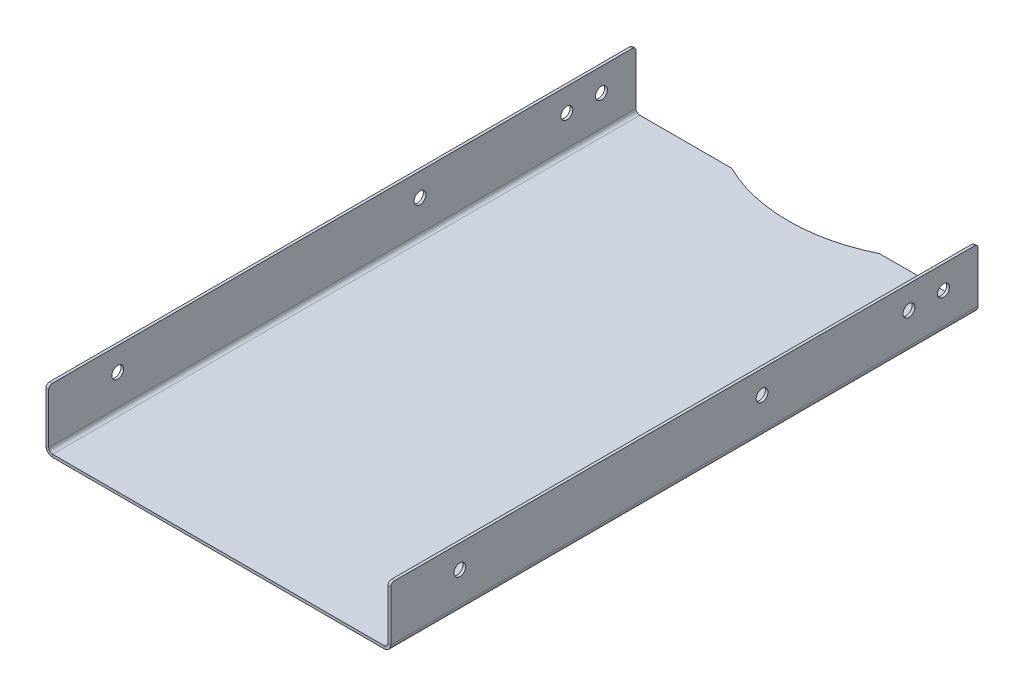
ISO-10303-21;
HEADER;
FILE_DESCRIPTION(('STEP AP214'),'2;1');
FILE_NAME('part.step','',(''),(''),'','','');
FILE_SCHEMA(('AUTOMOTIVE_DESIGN { 1 0 10303 214 1 1 1 1 }'));
ENDSEC;
DATA;
#1=APPLICATION_CONTEXT('core data for automotive mechanical design processes');
#2=APPLICATION_PROTOCOL_DEFINITION('international standard','automotive_design',2000,#1);
#3=PRODUCT_CONTEXT('',#1,'mechanical');
#4=PRODUCT('Part','Part','',(#3));
#5=PRODUCT_RELATED_PRODUCT_CATEGORY('part','',(#4));
#6=PRODUCT_DEFINITION_FORMATION('','',#4);
#7=PRODUCT_DEFINITION_CONTEXT('part definition',#1,'design');
#8=PRODUCT_DEFINITION('design','',#6,#7);
#9=PRODUCT_DEFINITION_SHAPE('','',#8);
#10=(LENGTH_UNIT() NAMED_UNIT(*) SI_UNIT(.MILLI.,.METRE.));
#11=(NAMED_UNIT(*) PLANE_ANGLE_UNIT() SI_UNIT($,.RADIAN.));
#12=(NAMED_UNIT(*) SI_UNIT($,.STERADIAN.) SOLID_ANGLE_UNIT());
#13=UNCERTAINTY_MEASURE_WITH_UNIT(LENGTH_MEASURE(1.E-05),#10,'distance_accuracy_value','');
#14=(GEOMETRIC_REPRESENTATION_CONTEXT(3) GLOBAL_UNCERTAINTY_ASSIGNED_CONTEXT((#13)) GLOBAL_UNIT_ASSIGNED_CONTEXT((#10,
#11,#12)) REPRESENTATION_CONTEXT('',''));
#15=CARTESIAN_POINT('',(0.,0.,0.));
#16=DIRECTION('',(0.,0.,1.));
#17=DIRECTION('',(1.,0.,0.));
#18=AXIS2_PLACEMENT_3D('',#15,#16,#17);
#19=CARTESIAN_POINT('',(0.,-1.9939,0.));
#20=DIRECTION('',(0.,-1.,0.));
#21=DIRECTION('',(0.,0.,-1.));
#22=AXIS2_PLACEMENT_3D('',#19,#20,#21);
#23=PLANE('',#22);
#24=DIRECTION('',(0.,0.,1.));
#25=VECTOR('',#24,1.);
#26=CARTESIAN_POINT('',(4.83996999999999,-1.9939,0.));
#27=LINE('',#26,#25);
#28=CARTESIAN_POINT('',(4.83996999999999,-1.9939,0.));
#29=VERTEX_POINT('',#28);
#30=CARTESIAN_POINT('',(4.83996999999999,-1.9939,-431.8));
#31=VERTEX_POINT('',#30);
#32=EDGE_CURVE('E279',#29,#31,#27,.F.);
#33=ORIENTED_EDGE('',*,*,#32,.T.);
#34=DIRECTION('',(1.,0.,0.));
#35=VECTOR('',#34,1.);
#36=CARTESIAN_POINT('',(38.6039093751587,-1.9939,-431.8));
#37=LINE('',#36,#35);
#38=CARTESIAN_POINT('',(72.3678487503174,-1.9939,-431.8));
#39=VERTEX_POINT('',#38);
#40=EDGE_CURVE('E380',#39,#31,#37,.F.);
#41=ORIENTED_EDGE('',*,*,#40,.F.);
#42=CARTESIAN_POINT('',(126.746,-1.9939,-541.866666666666));
#43=DIRECTION('',(0.,-1.,0.));
#44=DIRECTION('',(0.,0.,1.));
#45=AXIS2_PLACEMENT_3D('',#42,#43,#44);
#46=CIRCLE('',#45,122.766666666667);
#47=CARTESIAN_POINT('',(181.124151249683,-1.9939,-431.8));
#48=VERTEX_POINT('',#47);
#49=EDGE_CURVE('E237',#48,#39,#46,.T.);
#50=ORIENTED_EDGE('',*,*,#49,.F.);
#51=DIRECTION('',(1.,0.,0.));
#52=VECTOR('',#51,1.);
#53=CARTESIAN_POINT('',(0.,-1.9939,-431.8));
#54=LINE('',#53,#52);
#55=CARTESIAN_POINT('',(248.65203,-1.9939,-431.8));
#56=VERTEX_POINT('',#55);
#57=EDGE_CURVE('E207',#48,#56,#54,.T.);
#58=ORIENTED_EDGE('',*,*,#57,.T.);
#59=DIRECTION('',(0.,0.,-1.));
#60=VECTOR('',#59,1.);
#61=CARTESIAN_POINT('',(248.65203,-1.99390000000002,-457.2));
#62=LINE('',#61,#60);
#63=CARTESIAN_POINT('',(248.65203,-1.9939,0.));
#64=VERTEX_POINT('',#63);
#65=EDGE_CURVE('E233',#56,#64,#62,.F.);
#66=ORIENTED_EDGE('',*,*,#65,.T.);
#67=DIRECTION('',(1.,0.,0.));
#68=VECTOR('',#67,1.);
#69=CARTESIAN_POINT('',(0.,-1.9939,0.));
#70=LINE('',#69,#68);
#71=EDGE_CURVE('E293',#29,#64,#70,.T.);
#72=ORIENTED_EDGE('',*,*,#71,.F.);
#73=EDGE_LOOP('',(#33,#41,#50,#58,#66,#72));
#74=FACE_BOUND('',#73,.T.);
#75=ADVANCED_FACE('F78',(#74),#23,.T.);
#76=CARTESIAN_POINT('',(0.,0.,0.));
#77=DIRECTION('',(0.,-1.,0.));
#78=DIRECTION('',(0.,0.,-1.));
#79=AXIS2_PLACEMENT_3D('',#76,#77,#78);
#80=PLANE('',#79);
#81=DIRECTION('',(-1.,0.,0.));
#82=VECTOR('',#81,1.);
#83=CARTESIAN_POINT('',(0.,0.,-431.8));
#84=LINE('',#83,#82);
#85=CARTESIAN_POINT('',(72.3678487503174,0.,-431.8));
#86=VERTEX_POINT('',#85);
#87=CARTESIAN_POINT('',(4.83996999999999,0.,-431.8));
#88=VERTEX_POINT('',#87);
#89=EDGE_CURVE('E419',#86,#88,#84,.T.);
#90=ORIENTED_EDGE('',*,*,#89,.T.);
#91=DIRECTION('',(0.,0.,1.));
#92=VECTOR('',#91,1.);
#93=CARTESIAN_POINT('',(4.83996999999999,0.,0.));
#94=LINE('',#93,#92);
#95=CARTESIAN_POINT('',(4.83996999999999,0.,0.));
#96=VERTEX_POINT('',#95);
#97=EDGE_CURVE('E285',#96,#88,#94,.F.);
#98=ORIENTED_EDGE('',*,*,#97,.F.);
#99=DIRECTION('',(1.,0.,0.));
#100=VECTOR('',#99,1.);
#101=CARTESIAN_POINT('',(0.,0.,0.));
#102=LINE('',#101,#100);
#103=CARTESIAN_POINT('',(248.65203,0.,0.));
#104=VERTEX_POINT('',#103);
#105=EDGE_CURVE('E292',#96,#104,#102,.T.);
#106=ORIENTED_EDGE('',*,*,#105,.T.);
#107=DIRECTION('',(0.,0.,-1.));
#108=VECTOR('',#107,1.);
#109=CARTESIAN_POINT('',(248.65203,0.,-457.2));
#110=LINE('',#109,#108);
#111=CARTESIAN_POINT('',(248.65203,0.,-431.8));
#112=VERTEX_POINT('',#111);
#113=EDGE_CURVE('E249',#112,#104,#110,.F.);
#114=ORIENTED_EDGE('',*,*,#113,.F.);
#115=DIRECTION('',(1.,0.,0.));
#116=VECTOR('',#115,1.);
#117=CARTESIAN_POINT('',(214.888090624841,0.,-431.8));
#118=LINE('',#117,#116);
#119=CARTESIAN_POINT('',(181.124151249683,0.,-431.8));
#120=VERTEX_POINT('',#119);
#121=EDGE_CURVE('E210',#120,#112,#118,.T.);
#122=ORIENTED_EDGE('',*,*,#121,.F.);
#123=CARTESIAN_POINT('',(126.746,0.,-541.866666666666));
#124=DIRECTION('',(0.,-1.,0.));
#125=DIRECTION('',(0.,0.,-1.));
#126=AXIS2_PLACEMENT_3D('',#123,#124,#125);
#127=CIRCLE('',#126,122.766666666667);
#128=EDGE_CURVE('E439',#120,#86,#127,.T.);
#129=ORIENTED_EDGE('',*,*,#128,.T.);
#130=EDGE_LOOP('',(#90,#98,#106,#114,#122,#129));
#131=FACE_BOUND('',#130,.T.);
#132=ADVANCED_FACE('F509',(#131),#80,.F.);
#133=CARTESIAN_POINT('',(4.83996999999999,2.84607,0.));
#134=DIRECTION('',(0.,0.,1.));
#135=DIRECTION('',(-1.,0.,0.));
#136=AXIS2_PLACEMENT_3D('',#133,#134,#135);
#137=CYLINDRICAL_SURFACE('',#136,4.83997);
#138=DIRECTION('',(0.,0.,1.));
#139=VECTOR('',#138,1.);
#140=CARTESIAN_POINT('',(0.,2.84606999999998,-457.2));
#141=LINE('',#140,#139);
#142=CARTESIAN_POINT('',(0.,2.84606999999998,0.));
#143=VERTEX_POINT('',#142);
#144=CARTESIAN_POINT('',(0.,2.84606999999998,-431.8));
#145=VERTEX_POINT('',#144);
#146=EDGE_CURVE('E272',#143,#145,#141,.F.);
#147=ORIENTED_EDGE('',*,*,#146,.T.);
#148=CARTESIAN_POINT('',(4.83996999999999,2.84607,-431.8));
#149=DIRECTION('',(0.,0.,1.));
#150=DIRECTION('',(1.,0.,0.));
#151=AXIS2_PLACEMENT_3D('',#148,#149,#150);
#152=CIRCLE('',#151,4.83997);
#153=EDGE_CURVE('E385',#31,#145,#152,.F.);
#154=ORIENTED_EDGE('',*,*,#153,.F.);
#155=ORIENTED_EDGE('',*,*,#32,.F.);
#156=CARTESIAN_POINT('',(4.83996999999999,2.84607,0.));
#157=DIRECTION('',(0.,0.,1.));
#158=DIRECTION('',(1.,0.,0.));
#159=AXIS2_PLACEMENT_3D('',#156,#157,#158);
#160=CIRCLE('',#159,4.83997);
#161=EDGE_CURVE('E282',#143,#29,#160,.T.);
#162=ORIENTED_EDGE('',*,*,#161,.F.);
#163=EDGE_LOOP('',(#147,#154,#155,#162));
#164=FACE_BOUND('',#163,.T.);
#165=ADVANCED_FACE('F383',(#164),#137,.T.);
#166=CARTESIAN_POINT('',(4.83996999999999,2.84607,0.));
#167=DIRECTION('',(0.,0.,1.));
#168=DIRECTION('',(-1.,0.,0.));
#169=AXIS2_PLACEMENT_3D('',#166,#167,#168);
#170=CYLINDRICAL_SURFACE('',#169,2.84607);
#171=CARTESIAN_POINT('',(4.83996999999999,2.84607,-431.8));
#172=DIRECTION('',(0.,0.,1.));
#173=DIRECTION('',(1.,0.,0.));
#174=AXIS2_PLACEMENT_3D('',#171,#172,#173);
#175=CIRCLE('',#174,2.84607);
#176=CARTESIAN_POINT('',(1.99389999999999,2.84606999999999,-431.8));
#177=VERTEX_POINT('',#176);
#178=EDGE_CURVE('E430',#88,#177,#175,.F.);
#179=ORIENTED_EDGE('',*,*,#178,.T.);
#180=DIRECTION('',(0.,0.,1.));
#181=VECTOR('',#180,1.);
#182=CARTESIAN_POINT('',(1.99389999999999,2.84606999999999,-457.2));
#183=LINE('',#182,#181);
#184=CARTESIAN_POINT('',(1.99389999999999,2.84606999999999,0.));
#185=VERTEX_POINT('',#184);
#186=EDGE_CURVE('E258',#177,#185,#183,.T.);
#187=ORIENTED_EDGE('',*,*,#186,.T.);
#188=CARTESIAN_POINT('',(4.83996999999999,2.84607,0.));
#189=DIRECTION('',(0.,0.,1.));
#190=DIRECTION('',(1.,0.,0.));
#191=AXIS2_PLACEMENT_3D('',#188,#189,#190);
#192=CIRCLE('',#191,2.84607);
#193=EDGE_CURVE('E262',#185,#96,#192,.T.);
#194=ORIENTED_EDGE('',*,*,#193,.T.);
#195=ORIENTED_EDGE('',*,*,#97,.T.);
#196=EDGE_LOOP('',(#179,#187,#194,#195));
#197=FACE_BOUND('',#196,.T.);
#198=ADVANCED_FACE('F584',(#197),#170,.F.);
#199=CARTESIAN_POINT('',(0.,0.,0.));
#200=DIRECTION('',(1.,0.,0.));
#201=DIRECTION('',(0.,1.,0.));
#202=AXIS2_PLACEMENT_3D('',#199,#200,#201);
#203=PLANE('',#202);
#204=CARTESIAN_POINT('',(0.,25.3999999999999,-273.05));
#205=DIRECTION('',(-1.,0.,0.));
#206=DIRECTION('',(0.,0.,1.));
#207=AXIS2_PLACEMENT_3D('',#204,#205,#206);
#208=CIRCLE('',#207,4.36879999999997);
#209=CARTESIAN_POINT('',(0.,25.3999999999999,-268.6812));
#210=VERTEX_POINT('',#209);
#211=EDGE_CURVE('E467',#210,#210,#208,.T.);
#212=ORIENTED_EDGE('',*,*,#211,.F.);
#213=EDGE_LOOP('',(#212));
#214=FACE_BOUND('',#213,.T.);
#215=CARTESIAN_POINT('',(0.,25.3999999999999,-381.));
#216=DIRECTION('',(-1.,0.,0.));
#217=DIRECTION('',(0.,0.,1.));
#218=AXIS2_PLACEMENT_3D('',#215,#216,#217);
#219=CIRCLE('',#218,4.36879999999997);
#220=CARTESIAN_POINT('',(0.,25.3999999999999,-376.6312));
#221=VERTEX_POINT('',#220);
#222=EDGE_CURVE('E456',#221,#221,#219,.T.);
#223=ORIENTED_EDGE('',*,*,#222,.F.);
#224=EDGE_LOOP('',(#223));
#225=FACE_BOUND('',#224,.T.);
#226=CARTESIAN_POINT('',(0.,25.4,-50.8));
#227=DIRECTION('',(-1.,0.,0.));
#228=DIRECTION('',(0.,0.,1.));
#229=AXIS2_PLACEMENT_3D('',#226,#227,#228);
#230=CIRCLE('',#229,4.36879999999997);
#231=CARTESIAN_POINT('',(0.,25.4,-46.4312));
#232=VERTEX_POINT('',#231);
#233=EDGE_CURVE('E449',#232,#232,#230,.T.);
#234=ORIENTED_EDGE('',*,*,#233,.F.);
#235=EDGE_LOOP('',(#234));
#236=FACE_BOUND('',#235,.T.);
#237=CARTESIAN_POINT('',(0.,25.3999999999999,-406.4));
#238=DIRECTION('',(-1.,0.,0.));
#239=DIRECTION('',(0.,0.,1.));
#240=AXIS2_PLACEMENT_3D('',#237,#238,#239);
#241=CIRCLE('',#240,4.36879999999997);
#242=CARTESIAN_POINT('',(0.,25.3999999999999,-402.0312));
#243=VERTEX_POINT('',#242);
#244=EDGE_CURVE('E442',#243,#243,#241,.T.);
#245=ORIENTED_EDGE('',*,*,#244,.F.);
#246=EDGE_LOOP('',(#245));
#247=FACE_BOUND('',#246,.T.);
#248=DIRECTION('',(0.,0.,-1.));
#249=VECTOR('',#248,1.);
#250=CARTESIAN_POINT('',(-1.48234680870058E-13,42.4561,0.));
#251=LINE('',#250,#249);
#252=CARTESIAN_POINT('',(-1.48234680870058E-13,42.4561,-2.53999999999999));
#253=VERTEX_POINT('',#252);
#254=CARTESIAN_POINT('',(-1.48234680870058E-13,42.4561,-429.26));
#255=VERTEX_POINT('',#254);
#256=EDGE_CURVE('E259',#253,#255,#251,.T.);
#257=ORIENTED_EDGE('',*,*,#256,.T.);
#258=CARTESIAN_POINT('',(-1.39366318269396E-13,39.9161,-429.26));
#259=DIRECTION('',(1.,0.,0.));
#260=DIRECTION('',(0.,1.,0.));
#261=AXIS2_PLACEMENT_3D('',#258,#259,#260);
#262=CIRCLE('',#261,2.54);
#263=CARTESIAN_POINT('',(-1.39366318269396E-13,39.9161,-431.8));
#264=VERTEX_POINT('',#263);
#265=EDGE_CURVE('E321',#255,#264,#262,.F.);
#266=ORIENTED_EDGE('',*,*,#265,.T.);
#267=DIRECTION('',(0.,-1.,0.));
#268=VECTOR('',#267,1.);
#269=CARTESIAN_POINT('',(0.,0.,-431.8));
#270=LINE('',#269,#268);
#271=EDGE_CURVE('E398',#264,#145,#270,.T.);
#272=ORIENTED_EDGE('',*,*,#271,.T.);
#273=ORIENTED_EDGE('',*,*,#146,.F.);
#274=DIRECTION('',(0.,1.,0.));
#275=VECTOR('',#274,1.);
#276=CARTESIAN_POINT('',(0.,0.,0.));
#277=LINE('',#276,#275);
#278=CARTESIAN_POINT('',(-1.39366318269396E-13,39.9161,0.));
#279=VERTEX_POINT('',#278);
#280=EDGE_CURVE('E263',#143,#279,#277,.T.);
#281=ORIENTED_EDGE('',*,*,#280,.T.);
#282=CARTESIAN_POINT('',(-1.39366318269396E-13,39.9161,-2.53999999999999));
#283=DIRECTION('',(1.,0.,0.));
#284=DIRECTION('',(0.,1.,0.));
#285=AXIS2_PLACEMENT_3D('',#282,#283,#284);
#286=CIRCLE('',#285,2.54);
#287=EDGE_CURVE('E319',#279,#253,#286,.F.);
#288=ORIENTED_EDGE('',*,*,#287,.T.);
#289=EDGE_LOOP('',(#257,#266,#272,#273,#281,#288));
#290=FACE_BOUND('',#289,.T.);
#291=ADVANCED_FACE('F395',(#214,#225,#236,#247,#290),#203,.F.);
#292=CARTESIAN_POINT('',(1.9939,0.,0.));
#293=DIRECTION('',(1.,0.,0.));
#294=DIRECTION('',(0.,1.,0.));
#295=AXIS2_PLACEMENT_3D('',#292,#293,#294);
#296=PLANE('',#295);
#297=CARTESIAN_POINT('',(1.99389999999991,25.3999999999999,-406.4));
#298=DIRECTION('',(1.,0.,0.));
#299=DIRECTION('',(0.,1.,0.));
#300=AXIS2_PLACEMENT_3D('',#297,#298,#299);
#301=CIRCLE('',#300,4.36879999999995);
#302=CARTESIAN_POINT('',(1.9938999999999,29.7687999999999,-406.4));
#303=VERTEX_POINT('',#302);
#304=EDGE_CURVE('E312',#303,#303,#301,.T.);
#305=ORIENTED_EDGE('',*,*,#304,.F.);
#306=EDGE_LOOP('',(#305));
#307=FACE_BOUND('',#306,.T.);
#308=CARTESIAN_POINT('',(1.99389999999991,25.4,-50.8));
#309=DIRECTION('',(1.,0.,0.));
#310=DIRECTION('',(0.,1.,0.));
#311=AXIS2_PLACEMENT_3D('',#308,#309,#310);
#312=CIRCLE('',#311,4.36879999999995);
#313=CARTESIAN_POINT('',(1.9938999999999,29.7687999999999,-50.8));
#314=VERTEX_POINT('',#313);
#315=EDGE_CURVE('E307',#314,#314,#312,.T.);
#316=ORIENTED_EDGE('',*,*,#315,.F.);
#317=EDGE_LOOP('',(#316));
#318=FACE_BOUND('',#317,.T.);
#319=CARTESIAN_POINT('',(1.99389999999991,25.3999999999999,-381.));
#320=DIRECTION('',(1.,0.,0.));
#321=DIRECTION('',(0.,1.,0.));
#322=AXIS2_PLACEMENT_3D('',#319,#320,#321);
#323=CIRCLE('',#322,4.36879999999995);
#324=CARTESIAN_POINT('',(1.9938999999999,29.7687999999999,-381.));
#325=VERTEX_POINT('',#324);
#326=EDGE_CURVE('E465',#325,#325,#323,.T.);
#327=ORIENTED_EDGE('',*,*,#326,.F.);
#328=EDGE_LOOP('',(#327));
#329=FACE_BOUND('',#328,.T.);
#330=CARTESIAN_POINT('',(1.99389999999991,25.3999999999999,-273.05));
#331=DIRECTION('',(1.,0.,0.));
#332=DIRECTION('',(0.,1.,0.));
#333=AXIS2_PLACEMENT_3D('',#330,#331,#332);
#334=CIRCLE('',#333,4.36879999999995);
#335=CARTESIAN_POINT('',(1.9938999999999,29.7687999999999,-273.05));
#336=VERTEX_POINT('',#335);
#337=EDGE_CURVE('E302',#336,#336,#334,.T.);
#338=ORIENTED_EDGE('',*,*,#337,.F.);
#339=EDGE_LOOP('',(#338));
#340=FACE_BOUND('',#339,.T.);
#341=DIRECTION('',(0.,1.,0.));
#342=VECTOR('',#341,1.);
#343=CARTESIAN_POINT('',(1.99389999999992,22.651085,-431.8));
#344=LINE('',#343,#342);
#345=CARTESIAN_POINT('',(1.99389999999986,39.9161,-431.8));
#346=VERTEX_POINT('',#345);
#347=EDGE_CURVE('E214',#346,#177,#344,.F.);
#348=ORIENTED_EDGE('',*,*,#347,.F.);
#349=CARTESIAN_POINT('',(1.99389999999986,39.9161,-429.26));
#350=DIRECTION('',(1.,0.,0.));
#351=DIRECTION('',(0.,1.,0.));
#352=AXIS2_PLACEMENT_3D('',#349,#350,#351);
#353=CIRCLE('',#352,2.54);
#354=CARTESIAN_POINT('',(1.99389999999985,42.4561,-429.26));
#355=VERTEX_POINT('',#354);
#356=EDGE_CURVE('E327',#346,#355,#353,.T.);
#357=ORIENTED_EDGE('',*,*,#356,.T.);
#358=DIRECTION('',(0.,0.,1.));
#359=VECTOR('',#358,1.);
#360=CARTESIAN_POINT('',(1.99389999999985,42.4561,-457.2));
#361=LINE('',#360,#359);
#362=CARTESIAN_POINT('',(1.99389999999985,42.4561,-2.53999999999999));
#363=VERTEX_POINT('',#362);
#364=EDGE_CURVE('E266',#363,#355,#361,.F.);
#365=ORIENTED_EDGE('',*,*,#364,.F.);
#366=CARTESIAN_POINT('',(1.99389999999986,39.9161,-2.53999999999999));
#367=DIRECTION('',(1.,0.,0.));
#368=DIRECTION('',(0.,1.,0.));
#369=AXIS2_PLACEMENT_3D('',#366,#367,#368);
#370=CIRCLE('',#369,2.54);
#371=CARTESIAN_POINT('',(1.99389999999986,39.9161,0.));
#372=VERTEX_POINT('',#371);
#373=EDGE_CURVE('E325',#363,#372,#370,.T.);
#374=ORIENTED_EDGE('',*,*,#373,.T.);
#375=DIRECTION('',(0.,-1.,0.));
#376=VECTOR('',#375,1.);
#377=CARTESIAN_POINT('',(1.99389999999985,42.4561,0.));
#378=LINE('',#377,#376);
#379=EDGE_CURVE('E269',#185,#372,#378,.F.);
#380=ORIENTED_EDGE('',*,*,#379,.F.);
#381=ORIENTED_EDGE('',*,*,#186,.F.);
#382=EDGE_LOOP('',(#348,#357,#365,#374,#380,#381));
#383=FACE_BOUND('',#382,.T.);
#384=ADVANCED_FACE('F583',(#307,#318,#329,#340,#383),#296,.T.);
#385=CARTESIAN_POINT('',(-1.48318857196017E-13,42.4561,-457.2));
#386=DIRECTION('',(0.,-1.,0.));
#387=DIRECTION('',(1.,0.,0.));
#388=AXIS2_PLACEMENT_3D('',#385,#386,#387);
#389=PLANE('',#388);
#390=ORIENTED_EDGE('',*,*,#364,.T.);
#391=DIRECTION('',(1.,0.,0.));
#392=VECTOR('',#391,1.);
#393=CARTESIAN_POINT('',(-1.48318857196017E-13,42.4561,-429.26));
#394=LINE('',#393,#392);
#395=EDGE_CURVE('E316',#355,#255,#394,.F.);
#396=ORIENTED_EDGE('',*,*,#395,.T.);
#397=ORIENTED_EDGE('',*,*,#256,.F.);
#398=DIRECTION('',(1.,0.,0.));
#399=VECTOR('',#398,1.);
#400=CARTESIAN_POINT('',(-1.48318857196017E-13,42.4561,-2.53999999999999));
#401=LINE('',#400,#399);
#402=EDGE_CURVE('E296',#253,#363,#401,.T.);
#403=ORIENTED_EDGE('',*,*,#402,.T.);
#404=EDGE_LOOP('',(#390,#396,#397,#403));
#405=FACE_BOUND('',#404,.T.);
#406=ADVANCED_FACE('F405',(#405),#389,.F.);
#407=CARTESIAN_POINT('',(248.65203,2.84606999999999,-457.2));
#408=DIRECTION('',(0.,0.,-1.));
#409=DIRECTION('',(1.,0.,0.));
#410=AXIS2_PLACEMENT_3D('',#407,#408,#409);
#411=CYLINDRICAL_SURFACE('',#410,4.83997000000001);
#412=ORIENTED_EDGE('',*,*,#65,.F.);
#413=CARTESIAN_POINT('',(248.65203,2.84606999999999,-431.8));
#414=DIRECTION('',(0.,0.,1.));
#415=DIRECTION('',(1.,0.,0.));
#416=AXIS2_PLACEMENT_3D('',#413,#414,#415);
#417=CIRCLE('',#416,4.83997000000001);
#418=CARTESIAN_POINT('',(253.492,2.84606999999997,-431.8));
#419=VERTEX_POINT('',#418);
#420=EDGE_CURVE('E219',#419,#56,#417,.F.);
#421=ORIENTED_EDGE('',*,*,#420,.F.);
#422=DIRECTION('',(0.,0.,-1.));
#423=VECTOR('',#422,1.);
#424=CARTESIAN_POINT('',(253.492,2.84606999999997,0.));
#425=LINE('',#424,#423);
#426=CARTESIAN_POINT('',(253.492,2.84606999999997,0.));
#427=VERTEX_POINT('',#426);
#428=EDGE_CURVE('E361',#427,#419,#425,.T.);
#429=ORIENTED_EDGE('',*,*,#428,.F.);
#430=CARTESIAN_POINT('',(248.65203,2.84606999999999,0.));
#431=DIRECTION('',(0.,0.,-1.));
#432=DIRECTION('',(-1.,0.,0.));
#433=AXIS2_PLACEMENT_3D('',#430,#431,#432);
#434=CIRCLE('',#433,4.83997000000001);
#435=EDGE_CURVE('E242',#64,#427,#434,.F.);
#436=ORIENTED_EDGE('',*,*,#435,.F.);
#437=EDGE_LOOP('',(#412,#421,#429,#436));
#438=FACE_BOUND('',#437,.T.);
#439=ADVANCED_FACE('F240',(#438),#411,.T.);
#440=CARTESIAN_POINT('',(248.65203,2.84606999999999,-457.2));
#441=DIRECTION('',(0.,0.,-1.));
#442=DIRECTION('',(1.,0.,0.));
#443=AXIS2_PLACEMENT_3D('',#440,#441,#442);
#444=CYLINDRICAL_SURFACE('',#443,2.84607000000001);
#445=CARTESIAN_POINT('',(248.65203,2.84606999999999,-431.8));
#446=DIRECTION('',(0.,0.,-1.));
#447=DIRECTION('',(-1.,0.,0.));
#448=AXIS2_PLACEMENT_3D('',#445,#446,#447);
#449=CIRCLE('',#448,2.84607000000001);
#450=CARTESIAN_POINT('',(251.4981,2.84606999999998,-431.8));
#451=VERTEX_POINT('',#450);
#452=EDGE_CURVE('E226',#451,#112,#449,.T.);
#453=ORIENTED_EDGE('',*,*,#452,.T.);
#454=ORIENTED_EDGE('',*,*,#113,.T.);
#455=CARTESIAN_POINT('',(248.65203,2.84606999999999,0.));
#456=DIRECTION('',(0.,0.,-1.));
#457=DIRECTION('',(-1.,0.,0.));
#458=AXIS2_PLACEMENT_3D('',#455,#456,#457);
#459=CIRCLE('',#458,2.84607000000001);
#460=CARTESIAN_POINT('',(251.4981,2.84606999999998,0.));
#461=VERTEX_POINT('',#460);
#462=EDGE_CURVE('E244',#104,#461,#459,.F.);
#463=ORIENTED_EDGE('',*,*,#462,.T.);
#464=DIRECTION('',(0.,0.,1.));
#465=VECTOR('',#464,1.);
#466=CARTESIAN_POINT('',(251.4981,2.84606999999998,0.));
#467=LINE('',#466,#465);
#468=EDGE_CURVE('E356',#461,#451,#467,.F.);
#469=ORIENTED_EDGE('',*,*,#468,.T.);
#470=EDGE_LOOP('',(#453,#454,#463,#469));
#471=FACE_BOUND('',#470,.T.);
#472=ADVANCED_FACE('F568',(#471),#444,.F.);
#473=CARTESIAN_POINT('',(253.492,-1.00128046085083E-12,0.));
#474=DIRECTION('',(1.,0.,0.));
#475=DIRECTION('',(0.,1.,0.));
#476=AXIS2_PLACEMENT_3D('',#473,#474,#475);
#477=PLANE('',#476);
#478=CARTESIAN_POINT('',(253.492,25.3999999999999,-406.4));
#479=DIRECTION('',(-1.,0.,0.));
#480=DIRECTION('',(0.,0.,1.));
#481=AXIS2_PLACEMENT_3D('',#478,#479,#480);
#482=CIRCLE('',#481,4.36879999999994);
#483=CARTESIAN_POINT('',(253.492,25.3999999999999,-402.0312));
#484=VERTEX_POINT('',#483);
#485=EDGE_CURVE('E313',#484,#484,#482,.T.);
#486=ORIENTED_EDGE('',*,*,#485,.T.);
#487=EDGE_LOOP('',(#486));
#488=FACE_BOUND('',#487,.T.);
#489=CARTESIAN_POINT('',(253.492,25.4,-50.8));
#490=DIRECTION('',(-1.,0.,0.));
#491=DIRECTION('',(0.,0.,1.));
#492=AXIS2_PLACEMENT_3D('',#489,#490,#491);
#493=CIRCLE('',#492,4.36879999999994);
#494=CARTESIAN_POINT('',(253.492,25.4,-46.4312000000001));
#495=VERTEX_POINT('',#494);
#496=EDGE_CURVE('E308',#495,#495,#493,.T.);
#497=ORIENTED_EDGE('',*,*,#496,.T.);
#498=EDGE_LOOP('',(#497));
#499=FACE_BOUND('',#498,.T.);
#500=CARTESIAN_POINT('',(253.492,25.3999999999999,-381.));
#501=DIRECTION('',(-1.,0.,0.));
#502=DIRECTION('',(0.,0.,1.));
#503=AXIS2_PLACEMENT_3D('',#500,#501,#502);
#504=CIRCLE('',#503,4.36879999999994);
#505=CARTESIAN_POINT('',(253.492,25.3999999999999,-376.6312));
#506=VERTEX_POINT('',#505);
#507=EDGE_CURVE('E459',#506,#506,#504,.T.);
#508=ORIENTED_EDGE('',*,*,#507,.T.);
#509=EDGE_LOOP('',(#508));
#510=FACE_BOUND('',#509,.T.);
#511=CARTESIAN_POINT('',(253.492,25.3999999999999,-273.05));
#512=DIRECTION('',(-1.,0.,0.));
#513=DIRECTION('',(0.,0.,1.));
#514=AXIS2_PLACEMENT_3D('',#511,#512,#513);
#515=CIRCLE('',#514,4.36879999999994);
#516=CARTESIAN_POINT('',(253.492,25.3999999999999,-268.6812));
#517=VERTEX_POINT('',#516);
#518=EDGE_CURVE('E303',#517,#517,#515,.T.);
#519=ORIENTED_EDGE('',*,*,#518,.T.);
#520=EDGE_LOOP('',(#519));
#521=FACE_BOUND('',#520,.T.);
#522=DIRECTION('',(0.,1.,0.));
#523=VECTOR('',#522,1.);
#524=CARTESIAN_POINT('',(253.492,22.651085,-431.8));
#525=LINE('',#524,#523);
#526=CARTESIAN_POINT('',(253.492,39.9161,-431.8));
#527=VERTEX_POINT('',#526);
#528=EDGE_CURVE('E426',#527,#419,#525,.F.);
#529=ORIENTED_EDGE('',*,*,#528,.F.);
#530=CARTESIAN_POINT('',(253.492,39.9161,-429.26));
#531=DIRECTION('',(1.,0.,0.));
#532=DIRECTION('',(0.,1.,0.));
#533=AXIS2_PLACEMENT_3D('',#530,#531,#532);
#534=CIRCLE('',#533,2.54);
#535=CARTESIAN_POINT('',(253.492,42.4561,-429.26));
#536=VERTEX_POINT('',#535);
#537=EDGE_CURVE('E340',#527,#536,#534,.T.);
#538=ORIENTED_EDGE('',*,*,#537,.T.);
#539=DIRECTION('',(0.,0.,-1.));
#540=VECTOR('',#539,1.);
#541=CARTESIAN_POINT('',(253.492,42.4561,0.));
#542=LINE('',#541,#540);
#543=CARTESIAN_POINT('',(253.492,42.4561,-2.54));
#544=VERTEX_POINT('',#543);
#545=EDGE_CURVE('E357',#536,#544,#542,.F.);
#546=ORIENTED_EDGE('',*,*,#545,.T.);
#547=CARTESIAN_POINT('',(253.492,39.9161,-2.54));
#548=DIRECTION('',(1.,0.,0.));
#549=DIRECTION('',(0.,1.,0.));
#550=AXIS2_PLACEMENT_3D('',#547,#548,#549);
#551=CIRCLE('',#550,2.54);
#552=CARTESIAN_POINT('',(253.492,39.9161,0.));
#553=VERTEX_POINT('',#552);
#554=EDGE_CURVE('E93',#544,#553,#551,.T.);
#555=ORIENTED_EDGE('',*,*,#554,.T.);
#556=DIRECTION('',(0.,1.,0.));
#557=VECTOR('',#556,1.);
#558=CARTESIAN_POINT('',(253.492,-1.00128046085083E-12,0.));
#559=LINE('',#558,#557);
#560=EDGE_CURVE('E256',#553,#427,#559,.F.);
#561=ORIENTED_EDGE('',*,*,#560,.T.);
#562=ORIENTED_EDGE('',*,*,#428,.T.);
#563=EDGE_LOOP('',(#529,#538,#546,#555,#561,#562));
#564=FACE_BOUND('',#563,.T.);
#565=ADVANCED_FACE('F372',(#488,#499,#510,#521,#564),#477,.T.);
#566=CARTESIAN_POINT('',(251.4981,-9.94318796209309E-13,0.));
#567=DIRECTION('',(1.,0.,0.));
#568=DIRECTION('',(0.,1.,0.));
#569=AXIS2_PLACEMENT_3D('',#566,#567,#568);
#570=PLANE('',#569);
#571=CARTESIAN_POINT('',(251.4981,25.3999999999999,-273.05));
#572=DIRECTION('',(1.,0.,0.));
#573=DIRECTION('',(0.,1.,0.));
#574=AXIS2_PLACEMENT_3D('',#571,#572,#573);
#575=CIRCLE('',#574,4.36879999999995);
#576=CARTESIAN_POINT('',(251.4981,29.7687999999999,-273.05));
#577=VERTEX_POINT('',#576);
#578=EDGE_CURVE('E299',#577,#577,#575,.T.);
#579=ORIENTED_EDGE('',*,*,#578,.T.);
#580=EDGE_LOOP('',(#579));
#581=FACE_BOUND('',#580,.T.);
#582=CARTESIAN_POINT('',(251.4981,25.3999999999999,-381.));
#583=DIRECTION('',(1.,0.,0.));
#584=DIRECTION('',(0.,1.,0.));
#585=AXIS2_PLACEMENT_3D('',#582,#583,#584);
#586=CIRCLE('',#585,4.36879999999995);
#587=CARTESIAN_POINT('',(251.4981,29.7687999999999,-381.));
#588=VERTEX_POINT('',#587);
#589=EDGE_CURVE('E462',#588,#588,#586,.T.);
#590=ORIENTED_EDGE('',*,*,#589,.T.);
#591=EDGE_LOOP('',(#590));
#592=FACE_BOUND('',#591,.T.);
#593=CARTESIAN_POINT('',(251.4981,25.4,-50.8));
#594=DIRECTION('',(1.,0.,0.));
#595=DIRECTION('',(0.,1.,0.));
#596=AXIS2_PLACEMENT_3D('',#593,#594,#595);
#597=CIRCLE('',#596,4.36879999999995);
#598=CARTESIAN_POINT('',(251.4981,29.7687999999999,-50.8));
#599=VERTEX_POINT('',#598);
#600=EDGE_CURVE('E304',#599,#599,#597,.T.);
#601=ORIENTED_EDGE('',*,*,#600,.T.);
#602=EDGE_LOOP('',(#601));
#603=FACE_BOUND('',#602,.T.);
#604=CARTESIAN_POINT('',(251.4981,25.3999999999999,-406.4));
#605=DIRECTION('',(1.,0.,0.));
#606=DIRECTION('',(0.,1.,0.));
#607=AXIS2_PLACEMENT_3D('',#604,#605,#606);
#608=CIRCLE('',#607,4.36879999999995);
#609=CARTESIAN_POINT('',(251.4981,29.7687999999999,-406.4));
#610=VERTEX_POINT('',#609);
#611=EDGE_CURVE('E309',#610,#610,#608,.T.);
#612=ORIENTED_EDGE('',*,*,#611,.T.);
#613=EDGE_LOOP('',(#612));
#614=FACE_BOUND('',#613,.T.);
#615=DIRECTION('',(0.,0.,1.));
#616=VECTOR('',#615,1.);
#617=CARTESIAN_POINT('',(251.4981,42.4561,-457.2));
#618=LINE('',#617,#616);
#619=CARTESIAN_POINT('',(251.4981,42.4561,-429.26));
#620=VERTEX_POINT('',#619);
#621=CARTESIAN_POINT('',(251.4981,42.4561,-2.53999999999999));
#622=VERTEX_POINT('',#621);
#623=EDGE_CURVE('E358',#620,#622,#618,.T.);
#624=ORIENTED_EDGE('',*,*,#623,.F.);
#625=CARTESIAN_POINT('',(251.4981,39.9161,-429.26));
#626=DIRECTION('',(1.,0.,0.));
#627=DIRECTION('',(0.,1.,0.));
#628=AXIS2_PLACEMENT_3D('',#625,#626,#627);
#629=CIRCLE('',#628,2.54);
#630=CARTESIAN_POINT('',(251.4981,39.9161,-431.8));
#631=VERTEX_POINT('',#630);
#632=EDGE_CURVE('E336',#620,#631,#629,.F.);
#633=ORIENTED_EDGE('',*,*,#632,.T.);
#634=DIRECTION('',(0.,-1.,0.));
#635=VECTOR('',#634,1.);
#636=CARTESIAN_POINT('',(251.4981,42.4561,-431.8));
#637=LINE('',#636,#635);
#638=EDGE_CURVE('E227',#631,#451,#637,.T.);
#639=ORIENTED_EDGE('',*,*,#638,.T.);
#640=ORIENTED_EDGE('',*,*,#468,.F.);
#641=DIRECTION('',(0.,-1.,0.));
#642=VECTOR('',#641,1.);
#643=CARTESIAN_POINT('',(251.4981,42.4561,0.));
#644=LINE('',#643,#642);
#645=CARTESIAN_POINT('',(251.4981,39.9161,0.));
#646=VERTEX_POINT('',#645);
#647=EDGE_CURVE('E347',#646,#461,#644,.T.);
#648=ORIENTED_EDGE('',*,*,#647,.F.);
#649=CARTESIAN_POINT('',(251.4981,39.9161,-2.54));
#650=DIRECTION('',(1.,0.,0.));
#651=DIRECTION('',(0.,1.,0.));
#652=AXIS2_PLACEMENT_3D('',#649,#650,#651);
#653=CIRCLE('',#652,2.54);
#654=EDGE_CURVE('E334',#646,#622,#653,.F.);
#655=ORIENTED_EDGE('',*,*,#654,.T.);
#656=EDGE_LOOP('',(#624,#633,#639,#640,#648,#655));
#657=FACE_BOUND('',#656,.T.);
#658=ADVANCED_FACE('F353',(#581,#592,#603,#614,#657),#570,.F.);
#659=CARTESIAN_POINT('',(253.492,42.4561,-457.2));
#660=DIRECTION('',(0.,-1.,0.));
#661=DIRECTION('',(1.,0.,0.));
#662=AXIS2_PLACEMENT_3D('',#659,#660,#661);
#663=PLANE('',#662);
#664=ORIENTED_EDGE('',*,*,#545,.F.);
#665=DIRECTION('',(1.,0.,0.));
#666=VECTOR('',#665,1.);
#667=CARTESIAN_POINT('',(251.4981,42.4561,-429.26));
#668=LINE('',#667,#666);
#669=EDGE_CURVE('E331',#536,#620,#668,.F.);
#670=ORIENTED_EDGE('',*,*,#669,.T.);
#671=ORIENTED_EDGE('',*,*,#623,.T.);
#672=DIRECTION('',(-1.,0.,0.));
#673=VECTOR('',#672,1.);
#674=CARTESIAN_POINT('',(253.492,42.4561,-2.53999999999999));
#675=LINE('',#674,#673);
#676=EDGE_CURVE('E329',#622,#544,#675,.F.);
#677=ORIENTED_EDGE('',*,*,#676,.T.);
#678=EDGE_LOOP('',(#664,#670,#671,#677));
#679=FACE_BOUND('',#678,.T.);
#680=ADVANCED_FACE('F484',(#679),#663,.F.);
#681=CARTESIAN_POINT('',(126.746,42.4561,-541.866666666666));
#682=DIRECTION('',(0.,-1.,0.));
#683=DIRECTION('',(0.,0.,-1.));
#684=AXIS2_PLACEMENT_3D('',#681,#682,#683);
#685=CYLINDRICAL_SURFACE('',#684,122.766666666667);
#686=DIRECTION('',(0.,-1.,0.));
#687=VECTOR('',#686,1.);
#688=CARTESIAN_POINT('',(72.3678487503174,0.,-431.8));
#689=LINE('',#688,#687);
#690=EDGE_CURVE('E423',#39,#86,#689,.F.);
#691=ORIENTED_EDGE('',*,*,#690,.T.);
#692=ORIENTED_EDGE('',*,*,#128,.F.);
#693=DIRECTION('',(0.,1.,0.));
#694=VECTOR('',#693,1.);
#695=CARTESIAN_POINT('',(181.124151249683,-1.9939,-431.8));
#696=LINE('',#695,#694);
#697=EDGE_CURVE('E238',#120,#48,#696,.F.);
#698=ORIENTED_EDGE('',*,*,#697,.T.);
#699=ORIENTED_EDGE('',*,*,#49,.T.);
#700=EDGE_LOOP('',(#691,#692,#698,#699));
#701=FACE_BOUND('',#700,.T.);
#702=ADVANCED_FACE('F521',(#701),#685,.F.);
#703=CARTESIAN_POINT('',(0.,-1.9939,0.));
#704=DIRECTION('',(0.,0.,1.));
#705=DIRECTION('',(1.,0.,0.));
#706=AXIS2_PLACEMENT_3D('',#703,#704,#705);
#707=PLANE('',#706);
#708=DIRECTION('',(0.,-1.,0.));
#709=VECTOR('',#708,1.);
#710=CARTESIAN_POINT('',(248.65203,0.,0.));
#711=LINE('',#710,#709);
#712=EDGE_CURVE('E246',#104,#64,#711,.T.);
#713=ORIENTED_EDGE('',*,*,#712,.F.);
#714=ORIENTED_EDGE('',*,*,#105,.F.);
#715=DIRECTION('',(0.,-1.,0.));
#716=VECTOR('',#715,1.);
#717=CARTESIAN_POINT('',(4.83996999999999,0.,0.));
#718=LINE('',#717,#716);
#719=EDGE_CURVE('E281',#96,#29,#718,.T.);
#720=ORIENTED_EDGE('',*,*,#719,.T.);
#721=ORIENTED_EDGE('',*,*,#71,.T.);
#722=EDGE_LOOP('',(#713,#714,#720,#721));
#723=FACE_BOUND('',#722,.T.);
#724=ADVANCED_FACE('F379',(#723),#707,.T.);
#725=CARTESIAN_POINT('',(4.83996999999999,2.84607,0.));
#726=DIRECTION('',(0.,0.,-1.));
#727=DIRECTION('',(-1.,0.,0.));
#728=AXIS2_PLACEMENT_3D('',#725,#726,#727);
#729=PLANE('',#728);
#730=ORIENTED_EDGE('',*,*,#193,.F.);
#731=DIRECTION('',(1.,0.,0.));
#732=VECTOR('',#731,1.);
#733=CARTESIAN_POINT('',(1.99389999999999,2.84606999999999,0.));
#734=LINE('',#733,#732);
#735=EDGE_CURVE('E275',#185,#143,#734,.F.);
#736=ORIENTED_EDGE('',*,*,#735,.T.);
#737=ORIENTED_EDGE('',*,*,#161,.T.);
#738=ORIENTED_EDGE('',*,*,#719,.F.);
#739=EDGE_LOOP('',(#730,#736,#737,#738));
#740=FACE_BOUND('',#739,.T.);
#741=ADVANCED_FACE('F388',(#740),#729,.F.);
#742=CARTESIAN_POINT('',(-1.48318857196017E-13,42.4561,0.));
#743=DIRECTION('',(0.,0.,-1.));
#744=DIRECTION('',(-1.,0.,0.));
#745=AXIS2_PLACEMENT_3D('',#742,#743,#744);
#746=PLANE('',#745);
#747=ORIENTED_EDGE('',*,*,#379,.T.);
#748=DIRECTION('',(1.,0.,0.));
#749=VECTOR('',#748,1.);
#750=CARTESIAN_POINT('',(-1.39450494595355E-13,39.9161,0.));
#751=LINE('',#750,#749);
#752=EDGE_CURVE('E13',#372,#279,#751,.F.);
#753=ORIENTED_EDGE('',*,*,#752,.T.);
#754=ORIENTED_EDGE('',*,*,#280,.F.);
#755=ORIENTED_EDGE('',*,*,#735,.F.);
#756=EDGE_LOOP('',(#747,#753,#754,#755));
#757=FACE_BOUND('',#756,.T.);
#758=ADVANCED_FACE('F399',(#757),#746,.F.);
#759=CARTESIAN_POINT('',(248.65203,2.84606999999999,0.));
#760=DIRECTION('',(0.,0.,1.));
#761=DIRECTION('',(1.,0.,0.));
#762=AXIS2_PLACEMENT_3D('',#759,#760,#761);
#763=PLANE('',#762);
#764=DIRECTION('',(-1.,0.,0.));
#765=VECTOR('',#764,1.);
#766=CARTESIAN_POINT('',(253.492,2.84606999999997,0.));
#767=LINE('',#766,#765);
#768=EDGE_CURVE('E252',#461,#427,#767,.F.);
#769=ORIENTED_EDGE('',*,*,#768,.F.);
#770=ORIENTED_EDGE('',*,*,#462,.F.);
#771=ORIENTED_EDGE('',*,*,#712,.T.);
#772=ORIENTED_EDGE('',*,*,#435,.T.);
#773=EDGE_LOOP('',(#769,#770,#771,#772));
#774=FACE_BOUND('',#773,.T.);
#775=ADVANCED_FACE('F374',(#774),#763,.T.);
#776=CARTESIAN_POINT('',(253.492,42.4561,0.));
#777=DIRECTION('',(0.,0.,-1.));
#778=DIRECTION('',(-1.,0.,0.));
#779=AXIS2_PLACEMENT_3D('',#776,#777,#778);
#780=PLANE('',#779);
#781=ORIENTED_EDGE('',*,*,#560,.F.);
#782=DIRECTION('',(-1.,0.,0.));
#783=VECTOR('',#782,1.);
#784=CARTESIAN_POINT('',(253.492,39.9161,0.));
#785=LINE('',#784,#783);
#786=EDGE_CURVE('E86',#553,#646,#785,.T.);
#787=ORIENTED_EDGE('',*,*,#786,.T.);
#788=ORIENTED_EDGE('',*,*,#647,.T.);
#789=ORIENTED_EDGE('',*,*,#768,.T.);
#790=EDGE_LOOP('',(#781,#787,#788,#789));
#791=FACE_BOUND('',#790,.T.);
#792=ADVANCED_FACE('F345',(#791),#780,.F.);
#793=CARTESIAN_POINT('',(0.,25.3999999999999,-273.05));
#794=DIRECTION('',(-1.,0.,0.));
#795=DIRECTION('',(0.,0.,1.));
#796=AXIS2_PLACEMENT_3D('',#793,#794,#795);
#797=CYLINDRICAL_SURFACE('',#796,4.36879999999995);
#798=ORIENTED_EDGE('',*,*,#518,.F.);
#799=EDGE_LOOP('',(#798));
#800=FACE_BOUND('',#799,.T.);
#801=ORIENTED_EDGE('',*,*,#578,.F.);
#802=EDGE_LOOP('',(#801));
#803=FACE_BOUND('',#802,.T.);
#804=ADVANCED_FACE('F475',(#800,#803),#797,.F.);
#805=ORIENTED_EDGE('',*,*,#337,.T.);
#806=EDGE_LOOP('',(#805));
#807=FACE_BOUND('',#806,.T.);
#808=ORIENTED_EDGE('',*,*,#211,.T.);
#809=EDGE_LOOP('',(#808));
#810=FACE_BOUND('',#809,.T.);
#811=ADVANCED_FACE('F478',(#807,#810),#797,.F.);
#812=CARTESIAN_POINT('',(0.,25.3999999999999,-381.));
#813=DIRECTION('',(-1.,0.,0.));
#814=DIRECTION('',(0.,0.,1.));
#815=AXIS2_PLACEMENT_3D('',#812,#813,#814);
#816=CYLINDRICAL_SURFACE('',#815,4.36879999999995);
#817=ORIENTED_EDGE('',*,*,#507,.F.);
#818=EDGE_LOOP('',(#817));
#819=FACE_BOUND('',#818,.T.);
#820=ORIENTED_EDGE('',*,*,#589,.F.);
#821=EDGE_LOOP('',(#820));
#822=FACE_BOUND('',#821,.T.);
#823=ADVANCED_FACE('F753',(#819,#822),#816,.F.);
#824=ORIENTED_EDGE('',*,*,#326,.T.);
#825=EDGE_LOOP('',(#824));
#826=FACE_BOUND('',#825,.T.);
#827=ORIENTED_EDGE('',*,*,#222,.T.);
#828=EDGE_LOOP('',(#827));
#829=FACE_BOUND('',#828,.T.);
#830=ADVANCED_FACE('F744',(#826,#829),#816,.F.);
#831=CARTESIAN_POINT('',(0.,25.4,-50.8));
#832=DIRECTION('',(-1.,0.,0.));
#833=DIRECTION('',(0.,0.,1.));
#834=AXIS2_PLACEMENT_3D('',#831,#832,#833);
#835=CYLINDRICAL_SURFACE('',#834,4.36879999999995);
#836=ORIENTED_EDGE('',*,*,#496,.F.);
#837=EDGE_LOOP('',(#836));
#838=FACE_BOUND('',#837,.T.);
#839=ORIENTED_EDGE('',*,*,#600,.F.);
#840=EDGE_LOOP('',(#839));
#841=FACE_BOUND('',#840,.T.);
#842=ADVANCED_FACE('F503',(#838,#841),#835,.F.);
#843=ORIENTED_EDGE('',*,*,#315,.T.);
#844=EDGE_LOOP('',(#843));
#845=FACE_BOUND('',#844,.T.);
#846=ORIENTED_EDGE('',*,*,#233,.T.);
#847=EDGE_LOOP('',(#846));
#848=FACE_BOUND('',#847,.T.);
#849=ADVANCED_FACE('F495',(#845,#848),#835,.F.);
#850=CARTESIAN_POINT('',(0.,25.3999999999999,-406.4));
#851=DIRECTION('',(-1.,0.,0.));
#852=DIRECTION('',(0.,0.,1.));
#853=AXIS2_PLACEMENT_3D('',#850,#851,#852);
#854=CYLINDRICAL_SURFACE('',#853,4.36879999999995);
#855=ORIENTED_EDGE('',*,*,#485,.F.);
#856=EDGE_LOOP('',(#855));
#857=FACE_BOUND('',#856,.T.);
#858=ORIENTED_EDGE('',*,*,#611,.F.);
#859=EDGE_LOOP('',(#858));
#860=FACE_BOUND('',#859,.T.);
#861=ADVANCED_FACE('F492',(#857,#860),#854,.F.);
#862=ORIENTED_EDGE('',*,*,#304,.T.);
#863=EDGE_LOOP('',(#862));
#864=FACE_BOUND('',#863,.T.);
#865=ORIENTED_EDGE('',*,*,#244,.T.);
#866=EDGE_LOOP('',(#865));
#867=FACE_BOUND('',#866,.T.);
#868=ADVANCED_FACE('F494',(#864,#867),#854,.F.);
#869=CARTESIAN_POINT('',(248.65203,2.84606999999999,-431.8));
#870=DIRECTION('',(0.,0.,-1.));
#871=DIRECTION('',(-1.,0.,0.));
#872=AXIS2_PLACEMENT_3D('',#869,#870,#871);
#873=PLANE('',#872);
#874=ORIENTED_EDGE('',*,*,#420,.T.);
#875=DIRECTION('',(0.,-1.,0.));
#876=VECTOR('',#875,1.);
#877=CARTESIAN_POINT('',(248.65203,-1.9939,-431.8));
#878=LINE('',#877,#876);
#879=EDGE_CURVE('E203',#56,#112,#878,.F.);
#880=ORIENTED_EDGE('',*,*,#879,.T.);
#881=ORIENTED_EDGE('',*,*,#452,.F.);
#882=DIRECTION('',(1.,0.,0.));
#883=VECTOR('',#882,1.);
#884=CARTESIAN_POINT('',(253.492,2.84606999999997,-431.8));
#885=LINE('',#884,#883);
#886=EDGE_CURVE('E215',#419,#451,#885,.F.);
#887=ORIENTED_EDGE('',*,*,#886,.F.);
#888=EDGE_LOOP('',(#874,#880,#881,#887));
#889=FACE_BOUND('',#888,.T.);
#890=ADVANCED_FACE('F220',(#889),#873,.T.);
#891=CARTESIAN_POINT('',(251.4981,42.4561,-431.8));
#892=DIRECTION('',(0.,0.,1.));
#893=DIRECTION('',(0.,-1.,0.));
#894=AXIS2_PLACEMENT_3D('',#891,#892,#893);
#895=PLANE('',#894);
#896=ORIENTED_EDGE('',*,*,#638,.F.);
#897=DIRECTION('',(-1.,0.,0.));
#898=VECTOR('',#897,1.);
#899=CARTESIAN_POINT('',(253.492,39.9161,-431.8));
#900=LINE('',#899,#898);
#901=EDGE_CURVE('E101',#631,#527,#900,.F.);
#902=ORIENTED_EDGE('',*,*,#901,.T.);
#903=ORIENTED_EDGE('',*,*,#528,.T.);
#904=ORIENTED_EDGE('',*,*,#886,.T.);
#905=EDGE_LOOP('',(#896,#902,#903,#904));
#906=FACE_BOUND('',#905,.T.);
#907=ADVANCED_FACE('F537',(#906),#895,.F.);
#908=CARTESIAN_POINT('',(0.,-1.9939,-431.8));
#909=DIRECTION('',(0.,0.,1.));
#910=DIRECTION('',(1.,0.,0.));
#911=AXIS2_PLACEMENT_3D('',#908,#909,#910);
#912=PLANE('',#911);
#913=ORIENTED_EDGE('',*,*,#697,.F.);
#914=ORIENTED_EDGE('',*,*,#121,.T.);
#915=ORIENTED_EDGE('',*,*,#879,.F.);
#916=ORIENTED_EDGE('',*,*,#57,.F.);
#917=EDGE_LOOP('',(#913,#914,#915,#916));
#918=FACE_BOUND('',#917,.T.);
#919=ADVANCED_FACE('F205',(#918),#912,.F.);
#920=CARTESIAN_POINT('',(0.,0.,-431.8));
#921=DIRECTION('',(0.,0.,1.));
#922=DIRECTION('',(-1.,0.,0.));
#923=AXIS2_PLACEMENT_3D('',#920,#921,#922);
#924=PLANE('',#923);
#925=ORIENTED_EDGE('',*,*,#690,.F.);
#926=ORIENTED_EDGE('',*,*,#40,.T.);
#927=DIRECTION('',(0.,-1.,0.));
#928=VECTOR('',#927,1.);
#929=CARTESIAN_POINT('',(4.83996999999999,-1.9939,-431.8));
#930=LINE('',#929,#928);
#931=EDGE_CURVE('E433',#31,#88,#930,.F.);
#932=ORIENTED_EDGE('',*,*,#931,.T.);
#933=ORIENTED_EDGE('',*,*,#89,.F.);
#934=EDGE_LOOP('',(#925,#926,#932,#933));
#935=FACE_BOUND('',#934,.T.);
#936=ADVANCED_FACE('F544',(#935),#924,.F.);
#937=CARTESIAN_POINT('',(4.83996999999999,2.84607,-431.8));
#938=DIRECTION('',(0.,0.,-1.));
#939=DIRECTION('',(-1.,0.,0.));
#940=AXIS2_PLACEMENT_3D('',#937,#938,#939);
#941=PLANE('',#940);
#942=ORIENTED_EDGE('',*,*,#153,.T.);
#943=DIRECTION('',(-1.,0.,0.));
#944=VECTOR('',#943,1.);
#945=CARTESIAN_POINT('',(0.,2.84606999999999,-431.8));
#946=LINE('',#945,#944);
#947=EDGE_CURVE('E417',#145,#177,#946,.F.);
#948=ORIENTED_EDGE('',*,*,#947,.T.);
#949=ORIENTED_EDGE('',*,*,#178,.F.);
#950=ORIENTED_EDGE('',*,*,#931,.F.);
#951=EDGE_LOOP('',(#942,#948,#949,#950));
#952=FACE_BOUND('',#951,.T.);
#953=ADVANCED_FACE('F550',(#952),#941,.T.);
#954=CARTESIAN_POINT('',(0.,0.,-431.8));
#955=DIRECTION('',(0.,0.,1.));
#956=DIRECTION('',(0.,-1.,0.));
#957=AXIS2_PLACEMENT_3D('',#954,#955,#956);
#958=PLANE('',#957);
#959=ORIENTED_EDGE('',*,*,#271,.F.);
#960=DIRECTION('',(-1.,0.,0.));
#961=VECTOR('',#960,1.);
#962=CARTESIAN_POINT('',(1.99389999999986,39.9161,-431.8));
#963=LINE('',#962,#961);
#964=EDGE_CURVE('E323',#264,#346,#963,.F.);
#965=ORIENTED_EDGE('',*,*,#964,.T.);
#966=ORIENTED_EDGE('',*,*,#347,.T.);
#967=ORIENTED_EDGE('',*,*,#947,.F.);
#968=EDGE_LOOP('',(#959,#965,#966,#967));
#969=FACE_BOUND('',#968,.T.);
#970=ADVANCED_FACE('F414',(#969),#958,.F.);
#971=CARTESIAN_POINT('',(-1.39450494595355E-13,39.9161,-429.26));
#972=DIRECTION('',(-1.,0.,0.));
#973=DIRECTION('',(0.,-1.,0.));
#974=AXIS2_PLACEMENT_3D('',#971,#972,#973);
#975=CYLINDRICAL_SURFACE('',#974,2.54);
#976=ORIENTED_EDGE('',*,*,#356,.F.);
#977=ORIENTED_EDGE('',*,*,#964,.F.);
#978=ORIENTED_EDGE('',*,*,#265,.F.);
#979=ORIENTED_EDGE('',*,*,#395,.F.);
#980=EDGE_LOOP('',(#976,#977,#978,#979));
#981=FACE_BOUND('',#980,.T.);
#982=ADVANCED_FACE('F410',(#981),#975,.T.);
#983=CARTESIAN_POINT('',(253.492,39.9161,-429.26));
#984=DIRECTION('',(-1.,0.,0.));
#985=DIRECTION('',(0.,-1.,0.));
#986=AXIS2_PLACEMENT_3D('',#983,#984,#985);
#987=CYLINDRICAL_SURFACE('',#986,2.54);
#988=ORIENTED_EDGE('',*,*,#537,.F.);
#989=ORIENTED_EDGE('',*,*,#901,.F.);
#990=ORIENTED_EDGE('',*,*,#632,.F.);
#991=ORIENTED_EDGE('',*,*,#669,.F.);
#992=EDGE_LOOP('',(#988,#989,#990,#991));
#993=FACE_BOUND('',#992,.T.);
#994=ADVANCED_FACE('F524',(#993),#987,.T.);
#995=CARTESIAN_POINT('',(253.492,39.9161,-2.54));
#996=DIRECTION('',(-1.,0.,0.));
#997=DIRECTION('',(0.,-1.,0.));
#998=AXIS2_PLACEMENT_3D('',#995,#996,#997);
#999=CYLINDRICAL_SURFACE('',#998,2.54);
#1000=ORIENTED_EDGE('',*,*,#554,.F.);
#1001=ORIENTED_EDGE('',*,*,#676,.F.);
#1002=ORIENTED_EDGE('',*,*,#654,.F.);
#1003=ORIENTED_EDGE('',*,*,#786,.F.);
#1004=EDGE_LOOP('',(#1000,#1001,#1002,#1003));
#1005=FACE_BOUND('',#1004,.T.);
#1006=ADVANCED_FACE('F526',(#1005),#999,.T.);
#1007=CARTESIAN_POINT('',(-1.39450494595355E-13,39.9161,-2.53999999999999));
#1008=DIRECTION('',(1.,0.,0.));
#1009=DIRECTION('',(0.,1.,0.));
#1010=AXIS2_PLACEMENT_3D('',#1007,#1008,#1009);
#1011=CYLINDRICAL_SURFACE('',#1010,2.54);
#1012=ORIENTED_EDGE('',*,*,#287,.F.);
#1013=ORIENTED_EDGE('',*,*,#752,.F.);
#1014=ORIENTED_EDGE('',*,*,#373,.F.);
#1015=ORIENTED_EDGE('',*,*,#402,.F.);
#1016=EDGE_LOOP('',(#1012,#1013,#1014,#1015));
#1017=FACE_BOUND('',#1016,.T.);
#1018=ADVANCED_FACE('F80',(#1017),#1011,.T.);
#1019=CLOSED_SHELL('',(#75,#132,#165,#198,#291,#384,#406,#439,#472,#565,#658,#680,#702,#724,
#741,#758,#775,#792,#804,#811,#823,#830,#842,#849,#861,#868,#890,#907,#919,#936,#953,#970,#982,
#994,#1006,#1018));
#1020=MANIFOLD_SOLID_BREP('B2',#1019);
#1021=ADVANCED_BREP_SHAPE_REPRESENTATION('',(#18,#1020),#14);
#1022=SHAPE_DEFINITION_REPRESENTATION(#9,#1021);
ENDSEC;
END-ISO-10303-21;
